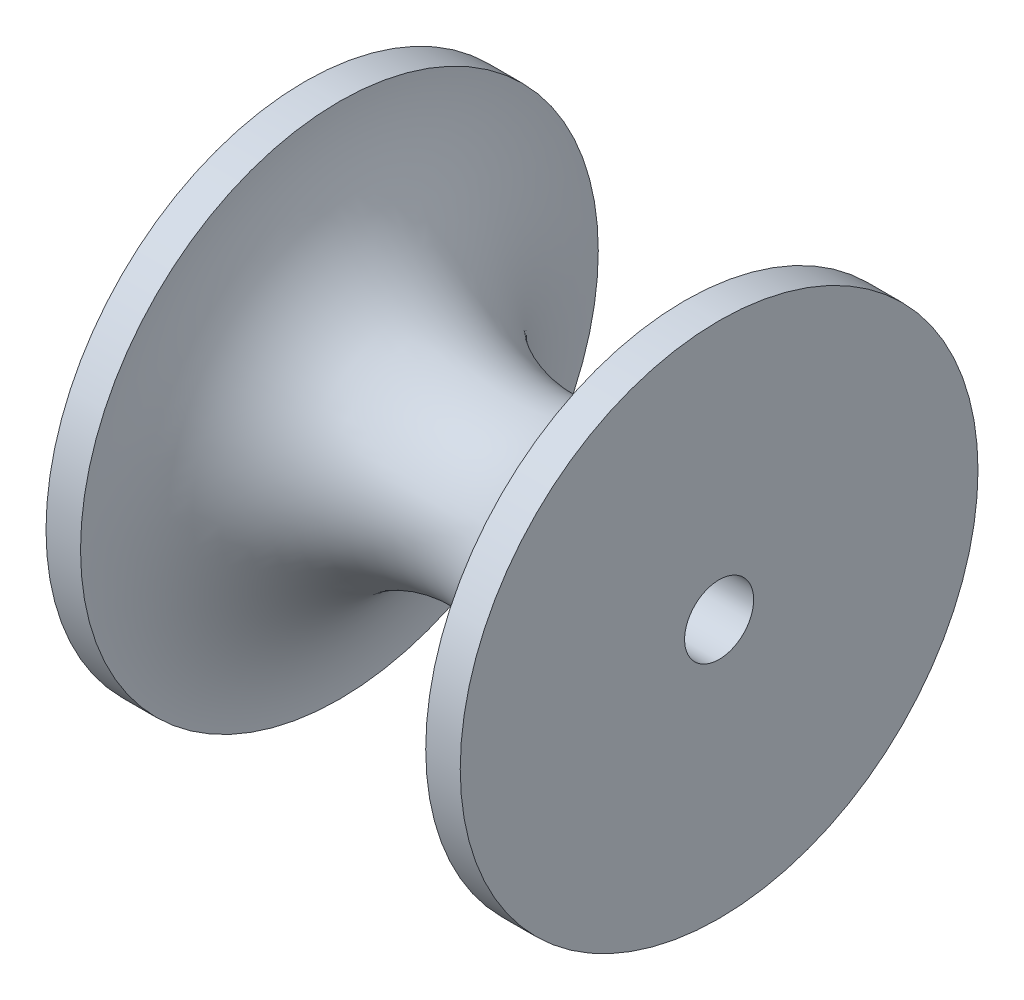
ISO-10303-21;
HEADER;
FILE_DESCRIPTION(('STEP AP214'),'2;1');
FILE_NAME('part.step','',(''),(''),'','','');
FILE_SCHEMA(('AUTOMOTIVE_DESIGN { 1 0 10303 214 1 1 1 1 }'));
ENDSEC;
DATA;
#1=APPLICATION_CONTEXT('core data for automotive mechanical design processes');
#2=APPLICATION_PROTOCOL_DEFINITION('international standard','automotive_design',2000,#1);
#3=PRODUCT_CONTEXT('',#1,'mechanical');
#4=PRODUCT('Part','Part','',(#3));
#5=PRODUCT_RELATED_PRODUCT_CATEGORY('part','',(#4));
#6=PRODUCT_DEFINITION_FORMATION('','',#4);
#7=PRODUCT_DEFINITION_CONTEXT('part definition',#1,'design');
#8=PRODUCT_DEFINITION('design','',#6,#7);
#9=PRODUCT_DEFINITION_SHAPE('','',#8);
#10=(LENGTH_UNIT() NAMED_UNIT(*) SI_UNIT(.MILLI.,.METRE.));
#11=(NAMED_UNIT(*) PLANE_ANGLE_UNIT() SI_UNIT($,.RADIAN.));
#12=(NAMED_UNIT(*) SI_UNIT($,.STERADIAN.) SOLID_ANGLE_UNIT());
#13=UNCERTAINTY_MEASURE_WITH_UNIT(LENGTH_MEASURE(1.E-05),#10,'distance_accuracy_value','');
#14=(GEOMETRIC_REPRESENTATION_CONTEXT(3) GLOBAL_UNCERTAINTY_ASSIGNED_CONTEXT((#13)) GLOBAL_UNIT_ASSIGNED_CONTEXT((#10,
#11,#12)) REPRESENTATION_CONTEXT('',''));
#15=CARTESIAN_POINT('',(0.,0.,0.));
#16=DIRECTION('',(0.,0.,1.));
#17=DIRECTION('',(1.,0.,0.));
#18=AXIS2_PLACEMENT_3D('',#15,#16,#17);
#19=CARTESIAN_POINT('',(12.,2.5,0.));
#20=DIRECTION('',(-1.,0.,0.));
#21=DIRECTION('',(0.,0.,1.));
#22=AXIS2_PLACEMENT_3D('',#19,#20,#21);
#23=PLANE('',#22);
#24=CARTESIAN_POINT('',(12.,-12.5,0.));
#25=DIRECTION('',(1.,0.,0.));
#26=DIRECTION('',(0.,0.,-1.));
#27=AXIS2_PLACEMENT_3D('',#24,#25,#26);
#28=CIRCLE('',#27,2.);
#29=CARTESIAN_POINT('',(12.,-12.5,-2.));
#30=VERTEX_POINT('',#29);
#31=EDGE_CURVE('E61',#30,#30,#28,.T.);
#32=ORIENTED_EDGE('',*,*,#31,.F.);
#33=EDGE_LOOP('',(#32));
#34=FACE_BOUND('',#33,.T.);
#35=CARTESIAN_POINT('',(12.,-12.5,0.));
#36=DIRECTION('',(-1.,0.,0.));
#37=DIRECTION('',(0.,0.,1.));
#38=AXIS2_PLACEMENT_3D('',#35,#36,#37);
#39=CIRCLE('',#38,15.);
#40=CARTESIAN_POINT('',(12.,-12.5,15.));
#41=VERTEX_POINT('',#40);
#42=EDGE_CURVE('E10',#41,#41,#39,.T.);
#43=ORIENTED_EDGE('',*,*,#42,.F.);
#44=EDGE_LOOP('',(#43));
#45=FACE_BOUND('',#44,.T.);
#46=ADVANCED_FACE('F37',(#34,#45),#23,.F.);
#47=CARTESIAN_POINT('',(-10.,-12.5,0.));
#48=DIRECTION('',(-1.,0.,0.));
#49=DIRECTION('',(0.,0.,1.));
#50=AXIS2_PLACEMENT_3D('',#47,#48,#49);
#51=CYLINDRICAL_SURFACE('',#50,15.);
#52=CARTESIAN_POINT('',(10.,-12.5,0.));
#53=DIRECTION('',(-1.,0.,0.));
#54=DIRECTION('',(0.,0.,1.));
#55=AXIS2_PLACEMENT_3D('',#52,#53,#54);
#56=CIRCLE('',#55,15.);
#57=CARTESIAN_POINT('',(10.,-12.5,15.));
#58=VERTEX_POINT('',#57);
#59=EDGE_CURVE('E44',#58,#58,#56,.T.);
#60=ORIENTED_EDGE('',*,*,#59,.F.);
#61=EDGE_LOOP('',(#60));
#62=FACE_BOUND('',#61,.T.);
#63=ORIENTED_EDGE('',*,*,#42,.T.);
#64=EDGE_LOOP('',(#63));
#65=FACE_BOUND('',#64,.T.);
#66=ADVANCED_FACE('F80',(#62,#65),#51,.T.);
#67=CARTESIAN_POINT('',(0.,-12.5,0.));
#68=DIRECTION('',(-1.,0.,0.));
#69=DIRECTION('',(0.,0.,1.));
#70=AXIS2_PLACEMENT_3D('',#67,#68,#69);
#71=TOROIDAL_SURFACE('',#70,15.,10.);
#72=CARTESIAN_POINT('',(-10.,-12.5,0.));
#73=DIRECTION('',(-1.,0.,0.));
#74=DIRECTION('',(0.,0.,1.));
#75=AXIS2_PLACEMENT_3D('',#72,#73,#74);
#76=CIRCLE('',#75,15.);
#77=CARTESIAN_POINT('',(-10.,-12.5,15.));
#78=VERTEX_POINT('',#77);
#79=EDGE_CURVE('E49',#78,#78,#76,.T.);
#80=ORIENTED_EDGE('',*,*,#79,.F.);
#81=EDGE_LOOP('',(#80));
#82=FACE_BOUND('',#81,.T.);
#83=ORIENTED_EDGE('',*,*,#59,.T.);
#84=EDGE_LOOP('',(#83));
#85=FACE_BOUND('',#84,.T.);
#86=ADVANCED_FACE('F84',(#82,#85),#71,.F.);
#87=CARTESIAN_POINT('',(-10.,-12.5,0.));
#88=DIRECTION('',(-1.,0.,0.));
#89=DIRECTION('',(0.,0.,1.));
#90=AXIS2_PLACEMENT_3D('',#87,#88,#89);
#91=CYLINDRICAL_SURFACE('',#90,15.);
#92=CARTESIAN_POINT('',(-12.,-12.5,0.));
#93=DIRECTION('',(-1.,0.,0.));
#94=DIRECTION('',(0.,0.,1.));
#95=AXIS2_PLACEMENT_3D('',#92,#93,#94);
#96=CIRCLE('',#95,15.);
#97=CARTESIAN_POINT('',(-12.,-12.5,15.));
#98=VERTEX_POINT('',#97);
#99=EDGE_CURVE('E54',#98,#98,#96,.T.);
#100=ORIENTED_EDGE('',*,*,#99,.F.);
#101=EDGE_LOOP('',(#100));
#102=FACE_BOUND('',#101,.T.);
#103=ORIENTED_EDGE('',*,*,#79,.T.);
#104=EDGE_LOOP('',(#103));
#105=FACE_BOUND('',#104,.T.);
#106=ADVANCED_FACE('F89',(#102,#105),#91,.T.);
#107=CARTESIAN_POINT('',(-12.,2.5,0.));
#108=DIRECTION('',(1.,0.,0.));
#109=DIRECTION('',(0.,0.,-1.));
#110=AXIS2_PLACEMENT_3D('',#107,#108,#109);
#111=PLANE('',#110);
#112=CARTESIAN_POINT('',(-12.,-12.5,0.));
#113=DIRECTION('',(1.,0.,0.));
#114=DIRECTION('',(0.,0.,-1.));
#115=AXIS2_PLACEMENT_3D('',#112,#113,#114);
#116=CIRCLE('',#115,2.);
#117=CARTESIAN_POINT('',(-12.,-12.5,-2.));
#118=VERTEX_POINT('',#117);
#119=EDGE_CURVE('E60',#118,#118,#116,.T.);
#120=ORIENTED_EDGE('',*,*,#119,.T.);
#121=EDGE_LOOP('',(#120));
#122=FACE_BOUND('',#121,.T.);
#123=ORIENTED_EDGE('',*,*,#99,.T.);
#124=EDGE_LOOP('',(#123));
#125=FACE_BOUND('',#124,.T.);
#126=ADVANCED_FACE('F69',(#122,#125),#111,.F.);
#127=CARTESIAN_POINT('',(-12.,-12.5,0.));
#128=DIRECTION('',(1.,0.,0.));
#129=DIRECTION('',(0.,0.,-1.));
#130=AXIS2_PLACEMENT_3D('',#127,#128,#129);
#131=CYLINDRICAL_SURFACE('',#130,2.);
#132=ORIENTED_EDGE('',*,*,#119,.F.);
#133=EDGE_LOOP('',(#132));
#134=FACE_BOUND('',#133,.T.);
#135=ORIENTED_EDGE('',*,*,#31,.T.);
#136=EDGE_LOOP('',(#135));
#137=FACE_BOUND('',#136,.T.);
#138=ADVANCED_FACE('F72',(#134,#137),#131,.F.);
#139=CLOSED_SHELL('',(#46,#66,#86,#106,#126,#138));
#140=MANIFOLD_SOLID_BREP('B2',#139);
#141=ADVANCED_BREP_SHAPE_REPRESENTATION('',(#18,#140),#14);
#142=SHAPE_DEFINITION_REPRESENTATION(#9,#141);
ENDSEC;
END-ISO-10303-21;
